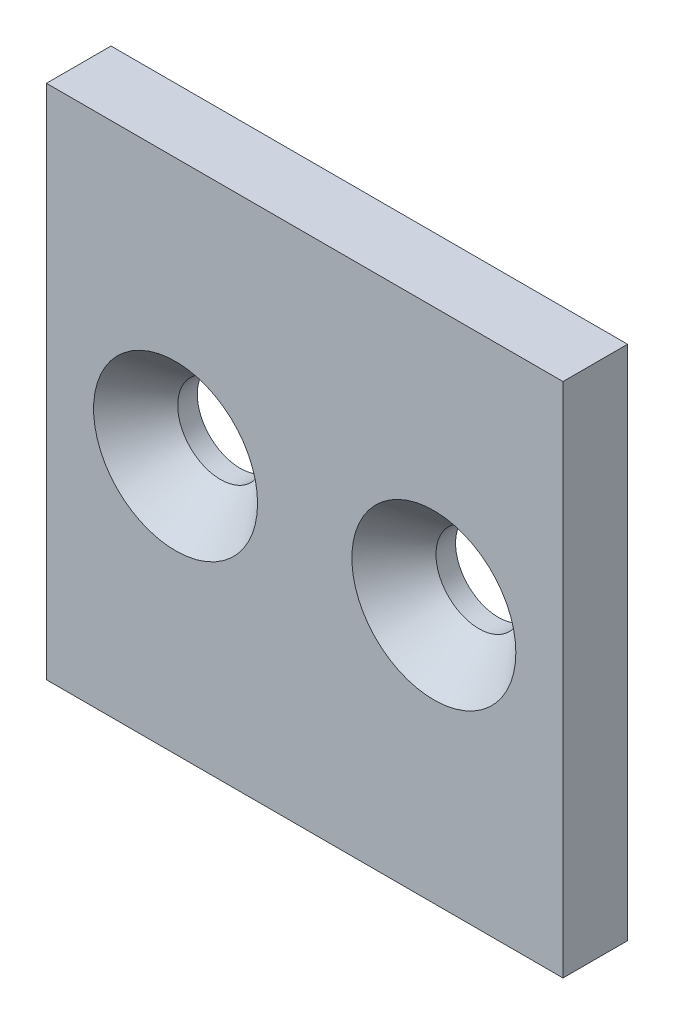
ISO-10303-21;
HEADER;
FILE_DESCRIPTION(('STEP AP214'),'2;1');
FILE_NAME('part.step','',(''),(''),'','','');
FILE_SCHEMA(('AUTOMOTIVE_DESIGN { 1 0 10303 214 1 1 1 1 }'));
ENDSEC;
DATA;
#1=APPLICATION_CONTEXT('core data for automotive mechanical design processes');
#2=APPLICATION_PROTOCOL_DEFINITION('international standard','automotive_design',2000,#1);
#3=PRODUCT_CONTEXT('',#1,'mechanical');
#4=PRODUCT('Part','Part','',(#3));
#5=PRODUCT_RELATED_PRODUCT_CATEGORY('part','',(#4));
#6=PRODUCT_DEFINITION_FORMATION('','',#4);
#7=PRODUCT_DEFINITION_CONTEXT('part definition',#1,'design');
#8=PRODUCT_DEFINITION('design','',#6,#7);
#9=PRODUCT_DEFINITION_SHAPE('','',#8);
#10=(LENGTH_UNIT() NAMED_UNIT(*) SI_UNIT(.MILLI.,.METRE.));
#11=(NAMED_UNIT(*) PLANE_ANGLE_UNIT() SI_UNIT($,.RADIAN.));
#12=(NAMED_UNIT(*) SI_UNIT($,.STERADIAN.) SOLID_ANGLE_UNIT());
#13=UNCERTAINTY_MEASURE_WITH_UNIT(LENGTH_MEASURE(1.E-05),#10,'distance_accuracy_value','');
#14=(GEOMETRIC_REPRESENTATION_CONTEXT(3) GLOBAL_UNCERTAINTY_ASSIGNED_CONTEXT((#13)) GLOBAL_UNIT_ASSIGNED_CONTEXT((#10,
#11,#12)) REPRESENTATION_CONTEXT('',''));
#15=CARTESIAN_POINT('',(0.,0.,0.));
#16=DIRECTION('',(0.,0.,1.));
#17=DIRECTION('',(1.,0.,0.));
#18=AXIS2_PLACEMENT_3D('',#15,#16,#17);
#19=CARTESIAN_POINT('',(25.4,25.4,-6.35));
#20=DIRECTION('',(1.,0.,0.));
#21=DIRECTION('',(0.,1.,0.));
#22=AXIS2_PLACEMENT_3D('',#19,#20,#21);
#23=PLANE('',#22);
#24=DIRECTION('',(0.,1.,0.));
#25=VECTOR('',#24,1.);
#26=CARTESIAN_POINT('',(25.4,25.4,0.));
#27=LINE('',#26,#25);
#28=CARTESIAN_POINT('',(25.4,-25.4,0.));
#29=VERTEX_POINT('',#28);
#30=CARTESIAN_POINT('',(25.4,25.4,0.));
#31=VERTEX_POINT('',#30);
#32=EDGE_CURVE('E100',#29,#31,#27,.T.);
#33=ORIENTED_EDGE('',*,*,#32,.F.);
#34=DIRECTION('',(0.,0.,1.));
#35=VECTOR('',#34,1.);
#36=CARTESIAN_POINT('',(25.4,-25.4,-6.35));
#37=LINE('',#36,#35);
#38=CARTESIAN_POINT('',(25.4,-25.4,-6.35));
#39=VERTEX_POINT('',#38);
#40=EDGE_CURVE('E11',#39,#29,#37,.T.);
#41=ORIENTED_EDGE('',*,*,#40,.F.);
#42=DIRECTION('',(0.,1.,0.));
#43=VECTOR('',#42,1.);
#44=CARTESIAN_POINT('',(25.4,25.4,-6.35));
#45=LINE('',#44,#43);
#46=CARTESIAN_POINT('',(25.4,25.4,-6.35));
#47=VERTEX_POINT('',#46);
#48=EDGE_CURVE('E93',#39,#47,#45,.T.);
#49=ORIENTED_EDGE('',*,*,#48,.T.);
#50=DIRECTION('',(0.,0.,1.));
#51=VECTOR('',#50,1.);
#52=CARTESIAN_POINT('',(25.4,25.4,-6.35));
#53=LINE('',#52,#51);
#54=EDGE_CURVE('E76',#47,#31,#53,.T.);
#55=ORIENTED_EDGE('',*,*,#54,.T.);
#56=EDGE_LOOP('',(#33,#41,#49,#55));
#57=FACE_BOUND('',#56,.T.);
#58=ADVANCED_FACE('F33',(#57),#23,.T.);
#59=CARTESIAN_POINT('',(-25.4,-25.4,-6.35));
#60=DIRECTION('',(0.,-1.,0.));
#61=DIRECTION('',(0.,0.,-1.));
#62=AXIS2_PLACEMENT_3D('',#59,#60,#61);
#63=PLANE('',#62);
#64=DIRECTION('',(1.,0.,0.));
#65=VECTOR('',#64,1.);
#66=CARTESIAN_POINT('',(-25.4,-25.4,0.));
#67=LINE('',#66,#65);
#68=CARTESIAN_POINT('',(-25.4,-25.4,0.));
#69=VERTEX_POINT('',#68);
#70=EDGE_CURVE('E95',#69,#29,#67,.T.);
#71=ORIENTED_EDGE('',*,*,#70,.F.);
#72=DIRECTION('',(0.,0.,1.));
#73=VECTOR('',#72,1.);
#74=CARTESIAN_POINT('',(-25.4,-25.4,-6.35));
#75=LINE('',#74,#73);
#76=CARTESIAN_POINT('',(-25.4,-25.4,-6.35));
#77=VERTEX_POINT('',#76);
#78=EDGE_CURVE('E42',#77,#69,#75,.T.);
#79=ORIENTED_EDGE('',*,*,#78,.F.);
#80=DIRECTION('',(1.,0.,0.));
#81=VECTOR('',#80,1.);
#82=CARTESIAN_POINT('',(-25.4,-25.4,-6.35));
#83=LINE('',#82,#81);
#84=EDGE_CURVE('E90',#77,#39,#83,.T.);
#85=ORIENTED_EDGE('',*,*,#84,.T.);
#86=ORIENTED_EDGE('',*,*,#40,.T.);
#87=EDGE_LOOP('',(#71,#79,#85,#86));
#88=FACE_BOUND('',#87,.T.);
#89=ADVANCED_FACE('F137',(#88),#63,.T.);
#90=CARTESIAN_POINT('',(-25.4,25.4,-6.35));
#91=DIRECTION('',(-1.,0.,0.));
#92=DIRECTION('',(0.,-1.,0.));
#93=AXIS2_PLACEMENT_3D('',#90,#91,#92);
#94=PLANE('',#93);
#95=DIRECTION('',(0.,-1.,0.));
#96=VECTOR('',#95,1.);
#97=CARTESIAN_POINT('',(-25.4,25.4,0.));
#98=LINE('',#97,#96);
#99=CARTESIAN_POINT('',(-25.4,25.4,0.));
#100=VERTEX_POINT('',#99);
#101=EDGE_CURVE('E84',#100,#69,#98,.T.);
#102=ORIENTED_EDGE('',*,*,#101,.F.);
#103=DIRECTION('',(0.,0.,1.));
#104=VECTOR('',#103,1.);
#105=CARTESIAN_POINT('',(-25.4,25.4,-6.35));
#106=LINE('',#105,#104);
#107=CARTESIAN_POINT('',(-25.4,25.4,-6.35));
#108=VERTEX_POINT('',#107);
#109=EDGE_CURVE('E79',#108,#100,#106,.T.);
#110=ORIENTED_EDGE('',*,*,#109,.F.);
#111=DIRECTION('',(0.,-1.,0.));
#112=VECTOR('',#111,1.);
#113=CARTESIAN_POINT('',(-25.4,25.4,-6.35));
#114=LINE('',#113,#112);
#115=EDGE_CURVE('E82',#108,#77,#114,.T.);
#116=ORIENTED_EDGE('',*,*,#115,.T.);
#117=ORIENTED_EDGE('',*,*,#78,.T.);
#118=EDGE_LOOP('',(#102,#110,#116,#117));
#119=FACE_BOUND('',#118,.T.);
#120=ADVANCED_FACE('F81',(#119),#94,.T.);
#121=CARTESIAN_POINT('',(-25.4,25.4,-6.35));
#122=DIRECTION('',(0.,1.,0.));
#123=DIRECTION('',(0.,0.,1.));
#124=AXIS2_PLACEMENT_3D('',#121,#122,#123);
#125=PLANE('',#124);
#126=DIRECTION('',(-1.,0.,0.));
#127=VECTOR('',#126,1.);
#128=CARTESIAN_POINT('',(-25.4,25.4,0.));
#129=LINE('',#128,#127);
#130=EDGE_CURVE('E103',#31,#100,#129,.T.);
#131=ORIENTED_EDGE('',*,*,#130,.F.);
#132=ORIENTED_EDGE('',*,*,#54,.F.);
#133=DIRECTION('',(-1.,0.,0.));
#134=VECTOR('',#133,1.);
#135=CARTESIAN_POINT('',(-25.4,25.4,-6.35));
#136=LINE('',#135,#134);
#137=EDGE_CURVE('E89',#47,#108,#136,.T.);
#138=ORIENTED_EDGE('',*,*,#137,.T.);
#139=ORIENTED_EDGE('',*,*,#109,.T.);
#140=EDGE_LOOP('',(#131,#132,#138,#139));
#141=FACE_BOUND('',#140,.T.);
#142=ADVANCED_FACE('F92',(#141),#125,.T.);
#143=CARTESIAN_POINT('',(0.,0.,-6.35));
#144=DIRECTION('',(0.,0.,1.));
#145=DIRECTION('',(1.,0.,0.));
#146=AXIS2_PLACEMENT_3D('',#143,#144,#145);
#147=PLANE('',#146);
#148=CARTESIAN_POINT('',(-12.7,0.,-6.35));
#149=DIRECTION('',(0.,0.,1.));
#150=DIRECTION('',(1.,0.,0.));
#151=AXIS2_PLACEMENT_3D('',#148,#149,#150);
#152=CIRCLE('',#151,4.21639999999999);
#153=CARTESIAN_POINT('',(-8.48360000000001,0.,-6.35));
#154=VERTEX_POINT('',#153);
#155=EDGE_CURVE('E36',#154,#154,#152,.T.);
#156=ORIENTED_EDGE('',*,*,#155,.T.);
#157=EDGE_LOOP('',(#156));
#158=FACE_BOUND('',#157,.T.);
#159=CARTESIAN_POINT('',(12.7,0.,-6.35));
#160=DIRECTION('',(0.,0.,1.));
#161=DIRECTION('',(1.,0.,0.));
#162=AXIS2_PLACEMENT_3D('',#159,#160,#161);
#163=CIRCLE('',#162,4.21639999999999);
#164=CARTESIAN_POINT('',(16.9164,0.,-6.35));
#165=VERTEX_POINT('',#164);
#166=EDGE_CURVE('E104',#165,#165,#163,.T.);
#167=ORIENTED_EDGE('',*,*,#166,.T.);
#168=EDGE_LOOP('',(#167));
#169=FACE_BOUND('',#168,.T.);
#170=ORIENTED_EDGE('',*,*,#48,.F.);
#171=ORIENTED_EDGE('',*,*,#84,.F.);
#172=ORIENTED_EDGE('',*,*,#115,.F.);
#173=ORIENTED_EDGE('',*,*,#137,.F.);
#174=EDGE_LOOP('',(#170,#171,#172,#173));
#175=FACE_BOUND('',#174,.T.);
#176=ADVANCED_FACE('F88',(#158,#169,#175),#147,.F.);
#177=CARTESIAN_POINT('',(0.,0.,0.));
#178=DIRECTION('',(0.,0.,1.));
#179=DIRECTION('',(1.,0.,0.));
#180=AXIS2_PLACEMENT_3D('',#177,#178,#179);
#181=PLANE('',#180);
#182=CARTESIAN_POINT('',(-12.7,0.,0.));
#183=DIRECTION('',(0.,0.,1.));
#184=DIRECTION('',(1.,0.,0.));
#185=AXIS2_PLACEMENT_3D('',#182,#183,#184);
#186=CIRCLE('',#185,8.0645);
#187=CARTESIAN_POINT('',(-4.6355,0.,0.));
#188=VERTEX_POINT('',#187);
#189=EDGE_CURVE('E124',#188,#188,#186,.T.);
#190=ORIENTED_EDGE('',*,*,#189,.F.);
#191=EDGE_LOOP('',(#190));
#192=FACE_BOUND('',#191,.T.);
#193=CARTESIAN_POINT('',(12.7,0.,0.));
#194=DIRECTION('',(0.,0.,1.));
#195=DIRECTION('',(1.,0.,0.));
#196=AXIS2_PLACEMENT_3D('',#193,#194,#195);
#197=CIRCLE('',#196,8.0645);
#198=CARTESIAN_POINT('',(20.7645,0.,0.));
#199=VERTEX_POINT('',#198);
#200=EDGE_CURVE('E115',#199,#199,#197,.T.);
#201=ORIENTED_EDGE('',*,*,#200,.F.);
#202=EDGE_LOOP('',(#201));
#203=FACE_BOUND('',#202,.T.);
#204=ORIENTED_EDGE('',*,*,#32,.T.);
#205=ORIENTED_EDGE('',*,*,#130,.T.);
#206=ORIENTED_EDGE('',*,*,#101,.T.);
#207=ORIENTED_EDGE('',*,*,#70,.T.);
#208=EDGE_LOOP('',(#204,#205,#206,#207));
#209=FACE_BOUND('',#208,.T.);
#210=ADVANCED_FACE('F130',(#192,#203,#209),#181,.T.);
#211=CARTESIAN_POINT('',(12.7,0.,0.));
#212=DIRECTION('',(0.,0.,1.));
#213=DIRECTION('',(1.,0.,0.));
#214=AXIS2_PLACEMENT_3D('',#211,#212,#213);
#215=CYLINDRICAL_SURFACE('',#214,4.21639999999999);
#216=CARTESIAN_POINT('',(12.7,0.,-4.42673266782717));
#217=DIRECTION('',(0.,0.,1.));
#218=DIRECTION('',(1.,0.,0.));
#219=AXIS2_PLACEMENT_3D('',#216,#217,#218);
#220=CIRCLE('',#219,4.21639999999999);
#221=CARTESIAN_POINT('',(16.9164,0.,-4.42673266782717));
#222=VERTEX_POINT('',#221);
#223=EDGE_CURVE('E111',#222,#222,#220,.T.);
#224=ORIENTED_EDGE('',*,*,#223,.T.);
#225=EDGE_LOOP('',(#224));
#226=FACE_BOUND('',#225,.T.);
#227=ORIENTED_EDGE('',*,*,#166,.F.);
#228=EDGE_LOOP('',(#227));
#229=FACE_BOUND('',#228,.T.);
#230=ADVANCED_FACE('F133',(#226,#229),#215,.F.);
#231=CARTESIAN_POINT('',(12.7,0.,0.));
#232=DIRECTION('',(0.,0.,1.));
#233=DIRECTION('',(1.,0.,0.));
#234=AXIS2_PLACEMENT_3D('',#231,#232,#233);
#235=CONICAL_SURFACE('',#234,8.0645,0.715584993317675);
#236=ORIENTED_EDGE('',*,*,#223,.F.);
#237=EDGE_LOOP('',(#236));
#238=FACE_BOUND('',#237,.T.);
#239=ORIENTED_EDGE('',*,*,#200,.T.);
#240=EDGE_LOOP('',(#239));
#241=FACE_BOUND('',#240,.T.);
#242=ADVANCED_FACE('F157',(#238,#241),#235,.F.);
#243=CARTESIAN_POINT('',(-12.7,0.,0.));
#244=DIRECTION('',(0.,0.,1.));
#245=DIRECTION('',(1.,0.,0.));
#246=AXIS2_PLACEMENT_3D('',#243,#244,#245);
#247=CYLINDRICAL_SURFACE('',#246,4.21639999999999);
#248=CARTESIAN_POINT('',(-12.7,0.,-4.42673266782717));
#249=DIRECTION('',(0.,0.,1.));
#250=DIRECTION('',(1.,0.,0.));
#251=AXIS2_PLACEMENT_3D('',#248,#249,#250);
#252=CIRCLE('',#251,4.21639999999999);
#253=CARTESIAN_POINT('',(-8.4836,0.,-4.42673266782717));
#254=VERTEX_POINT('',#253);
#255=EDGE_CURVE('E121',#254,#254,#252,.T.);
#256=ORIENTED_EDGE('',*,*,#255,.T.);
#257=EDGE_LOOP('',(#256));
#258=FACE_BOUND('',#257,.T.);
#259=ORIENTED_EDGE('',*,*,#155,.F.);
#260=EDGE_LOOP('',(#259));
#261=FACE_BOUND('',#260,.T.);
#262=ADVANCED_FACE('F160',(#258,#261),#247,.F.);
#263=CARTESIAN_POINT('',(-12.7,0.,0.));
#264=DIRECTION('',(0.,0.,1.));
#265=DIRECTION('',(1.,0.,0.));
#266=AXIS2_PLACEMENT_3D('',#263,#264,#265);
#267=CONICAL_SURFACE('',#266,8.0645,0.715584993317676);
#268=ORIENTED_EDGE('',*,*,#255,.F.);
#269=EDGE_LOOP('',(#268));
#270=FACE_BOUND('',#269,.T.);
#271=ORIENTED_EDGE('',*,*,#189,.T.);
#272=EDGE_LOOP('',(#271));
#273=FACE_BOUND('',#272,.T.);
#274=ADVANCED_FACE('F128',(#270,#273),#267,.F.);
#275=CLOSED_SHELL('',(#58,#89,#120,#142,#176,#210,#230,#242,#262,#274));
#276=MANIFOLD_SOLID_BREP('B2',#275);
#277=ADVANCED_BREP_SHAPE_REPRESENTATION('',(#18,#276),#14);
#278=SHAPE_DEFINITION_REPRESENTATION(#9,#277);
ENDSEC;
END-ISO-10303-21;
